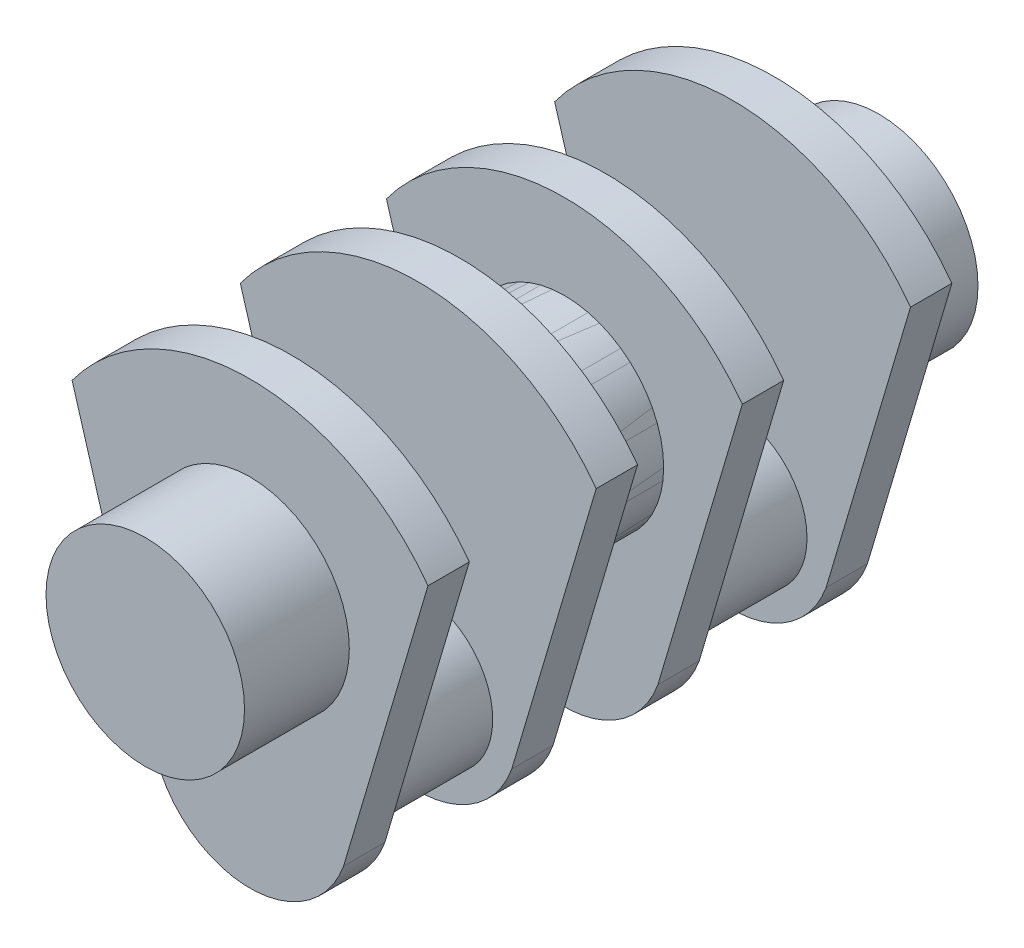
ISO-10303-21;
HEADER;
FILE_DESCRIPTION(('STEP AP214'),'2;1');
FILE_NAME('part.step','',(''),(''),'','','');
FILE_SCHEMA(('AUTOMOTIVE_DESIGN { 1 0 10303 214 1 1 1 1 }'));
ENDSEC;
DATA;
#1=APPLICATION_CONTEXT('core data for automotive mechanical design processes');
#2=APPLICATION_PROTOCOL_DEFINITION('international standard','automotive_design',2000,#1);
#3=PRODUCT_CONTEXT('',#1,'mechanical');
#4=PRODUCT('Part','Part','',(#3));
#5=PRODUCT_RELATED_PRODUCT_CATEGORY('part','',(#4));
#6=PRODUCT_DEFINITION_FORMATION('','',#4);
#7=PRODUCT_DEFINITION_CONTEXT('part definition',#1,'design');
#8=PRODUCT_DEFINITION('design','',#6,#7);
#9=PRODUCT_DEFINITION_SHAPE('','',#8);
#10=(LENGTH_UNIT() NAMED_UNIT(*) SI_UNIT(.MILLI.,.METRE.));
#11=(NAMED_UNIT(*) PLANE_ANGLE_UNIT() SI_UNIT($,.RADIAN.));
#12=(NAMED_UNIT(*) SI_UNIT($,.STERADIAN.) SOLID_ANGLE_UNIT());
#13=UNCERTAINTY_MEASURE_WITH_UNIT(LENGTH_MEASURE(1.E-05),#10,'distance_accuracy_value','');
#14=(GEOMETRIC_REPRESENTATION_CONTEXT(3) GLOBAL_UNCERTAINTY_ASSIGNED_CONTEXT((#13)) GLOBAL_UNIT_ASSIGNED_CONTEXT((#10,
#11,#12)) REPRESENTATION_CONTEXT('',''));
#15=CARTESIAN_POINT('',(0.,0.,0.));
#16=DIRECTION('',(0.,0.,1.));
#17=DIRECTION('',(1.,0.,0.));
#18=AXIS2_PLACEMENT_3D('',#15,#16,#17);
#19=CARTESIAN_POINT('',(2.31456892981108E-13,-335.586011734979,-4445.));
#20=DIRECTION('',(0.,0.,1.));
#21=DIRECTION('',(-1.,0.,0.));
#22=AXIS2_PLACEMENT_3D('',#19,#20,#21);
#23=CYLINDRICAL_SURFACE('',#22,2032.);
#24=CARTESIAN_POINT('',(2.31456892981108E-13,-335.586011734979,-4064.));
#25=DIRECTION('',(0.,0.,1.));
#26=DIRECTION('',(1.,0.,0.));
#27=AXIS2_PLACEMENT_3D('',#24,#25,#26);
#28=CIRCLE('',#27,2032.);
#29=CARTESIAN_POINT('',(-1639.0738814453,865.438888574685,-4064.));
#30=VERTEX_POINT('',#29);
#31=CARTESIAN_POINT('',(1639.0738814453,865.438888574686,-4064.));
#32=VERTEX_POINT('',#31);
#33=EDGE_CURVE('E164',#30,#32,#28,.F.);
#34=ORIENTED_EDGE('',*,*,#33,.T.);
#35=DIRECTION('',(0.,0.,1.));
#36=VECTOR('',#35,1.);
#37=CARTESIAN_POINT('',(1639.0738814453,865.438888574686,-4445.));
#38=LINE('',#37,#36);
#39=CARTESIAN_POINT('',(1639.0738814453,865.438888574686,-4445.));
#40=VERTEX_POINT('',#39);
#41=EDGE_CURVE('E172',#40,#32,#38,.T.);
#42=ORIENTED_EDGE('',*,*,#41,.F.);
#43=CARTESIAN_POINT('',(2.31456892981108E-13,-335.586011734979,-4445.));
#44=DIRECTION('',(0.,0.,1.));
#45=DIRECTION('',(1.,0.,0.));
#46=AXIS2_PLACEMENT_3D('',#43,#44,#45);
#47=CIRCLE('',#46,2032.);
#48=CARTESIAN_POINT('',(-1639.0738814453,865.438888574685,-4445.));
#49=VERTEX_POINT('',#48);
#50=EDGE_CURVE('E165',#49,#40,#47,.F.);
#51=ORIENTED_EDGE('',*,*,#50,.F.);
#52=DIRECTION('',(0.,0.,1.));
#53=VECTOR('',#52,1.);
#54=CARTESIAN_POINT('',(-1639.0738814453,865.438888574685,-4445.));
#55=LINE('',#54,#53);
#56=EDGE_CURVE('E186',#49,#30,#55,.T.);
#57=ORIENTED_EDGE('',*,*,#56,.T.);
#58=EDGE_LOOP('',(#34,#42,#51,#57));
#59=FACE_BOUND('',#58,.T.);
#60=ADVANCED_FACE('F53',(#59),#23,.T.);
#61=CARTESIAN_POINT('',(-1271.18255168187,-376.541426368504,-4445.));
#62=DIRECTION('',(0.958819734868193,0.284015344703924,0.));
#63=DIRECTION('',(-0.284015344703924,0.958819734868193,0.));
#64=AXIS2_PLACEMENT_3D('',#61,#62,#63);
#65=PLANE('',#64);
#66=DIRECTION('',(0.284015344703924,-0.958819734868193,0.));
#67=VECTOR('',#66,1.);
#68=CARTESIAN_POINT('',(-1271.18255168187,-376.541426368504,-4064.));
#69=LINE('',#68,#67);
#70=CARTESIAN_POINT('',(-861.351710039677,-1760.1071605855,-4064.));
#71=VERTEX_POINT('',#70);
#72=EDGE_CURVE('E175',#30,#71,#69,.T.);
#73=ORIENTED_EDGE('',*,*,#72,.F.);
#74=ORIENTED_EDGE('',*,*,#56,.F.);
#75=DIRECTION('',(0.284015344703924,-0.958819734868193,0.));
#76=VECTOR('',#75,1.);
#77=CARTESIAN_POINT('',(-1271.18255168187,-376.541426368504,-4445.));
#78=LINE('',#77,#76);
#79=CARTESIAN_POINT('',(-861.351710039677,-1760.1071605855,-4445.));
#80=VERTEX_POINT('',#79);
#81=EDGE_CURVE('E96',#49,#80,#78,.T.);
#82=ORIENTED_EDGE('',*,*,#81,.T.);
#83=DIRECTION('',(0.,0.,1.));
#84=VECTOR('',#83,1.);
#85=CARTESIAN_POINT('',(-861.351710039677,-1760.1071605855,-4445.));
#86=LINE('',#85,#84);
#87=EDGE_CURVE('E184',#80,#71,#86,.T.);
#88=ORIENTED_EDGE('',*,*,#87,.T.);
#89=EDGE_LOOP('',(#73,#74,#82,#88));
#90=FACE_BOUND('',#89,.T.);
#91=ADVANCED_FACE('F211',(#90),#65,.F.);
#92=CARTESIAN_POINT('',(0.,-1453.18601173498,-4445.));
#93=DIRECTION('',(0.,0.,1.));
#94=DIRECTION('',(-1.,0.,0.));
#95=AXIS2_PLACEMENT_3D('',#92,#93,#94);
#96=CYLINDRICAL_SURFACE('',#95,914.4);
#97=CARTESIAN_POINT('',(0.,-1453.18601173498,-4064.));
#98=DIRECTION('',(0.,0.,1.));
#99=DIRECTION('',(1.,0.,0.));
#100=AXIS2_PLACEMENT_3D('',#97,#98,#99);
#101=CIRCLE('',#100,914.4);
#102=CARTESIAN_POINT('',(861.351710039677,-1760.1071605855,-4064.));
#103=VERTEX_POINT('',#102);
#104=EDGE_CURVE('E178',#71,#103,#101,.T.);
#105=ORIENTED_EDGE('',*,*,#104,.F.);
#106=ORIENTED_EDGE('',*,*,#87,.F.);
#107=CARTESIAN_POINT('',(0.,-1453.18601173498,-4445.));
#108=DIRECTION('',(0.,0.,1.));
#109=DIRECTION('',(1.,0.,0.));
#110=AXIS2_PLACEMENT_3D('',#107,#108,#109);
#111=CIRCLE('',#110,914.4);
#112=CARTESIAN_POINT('',(861.351710039677,-1760.1071605855,-4445.));
#113=VERTEX_POINT('',#112);
#114=EDGE_CURVE('E168',#80,#113,#111,.T.);
#115=ORIENTED_EDGE('',*,*,#114,.T.);
#116=DIRECTION('',(0.,0.,1.));
#117=VECTOR('',#116,1.);
#118=CARTESIAN_POINT('',(861.351710039677,-1760.1071605855,-4445.));
#119=LINE('',#118,#117);
#120=EDGE_CURVE('E182',#113,#103,#119,.T.);
#121=ORIENTED_EDGE('',*,*,#120,.T.);
#122=EDGE_LOOP('',(#105,#106,#115,#121));
#123=FACE_BOUND('',#122,.T.);
#124=ADVANCED_FACE('F215',(#123),#96,.T.);
#125=CARTESIAN_POINT('',(1271.18255168187,-376.541426368504,-4445.));
#126=DIRECTION('',(0.958819734868193,-0.284015344703924,0.));
#127=DIRECTION('',(0.284015344703924,0.958819734868193,0.));
#128=AXIS2_PLACEMENT_3D('',#125,#126,#127);
#129=PLANE('',#128);
#130=DIRECTION('',(-0.284015344703924,-0.958819734868193,0.));
#131=VECTOR('',#130,1.);
#132=CARTESIAN_POINT('',(1271.18255168187,-376.541426368504,-4064.));
#133=LINE('',#132,#131);
#134=EDGE_CURVE('E85',#32,#103,#133,.T.);
#135=ORIENTED_EDGE('',*,*,#134,.T.);
#136=ORIENTED_EDGE('',*,*,#120,.F.);
#137=DIRECTION('',(-0.284015344703924,-0.958819734868193,0.));
#138=VECTOR('',#137,1.);
#139=CARTESIAN_POINT('',(1271.18255168187,-376.541426368504,-4445.));
#140=LINE('',#139,#138);
#141=EDGE_CURVE('E70',#40,#113,#140,.T.);
#142=ORIENTED_EDGE('',*,*,#141,.F.);
#143=ORIENTED_EDGE('',*,*,#41,.T.);
#144=EDGE_LOOP('',(#135,#136,#142,#143));
#145=FACE_BOUND('',#144,.T.);
#146=ADVANCED_FACE('F220',(#145),#129,.T.);
#147=CARTESIAN_POINT('',(0.,0.,-4445.));
#148=DIRECTION('',(0.,0.,-1.));
#149=DIRECTION('',(1.,0.,0.));
#150=AXIS2_PLACEMENT_3D('',#147,#148,#149);
#151=PLANE('',#150);
#152=CARTESIAN_POINT('',(0.,0.,-4445.));
#153=DIRECTION('',(0.,0.,1.));
#154=DIRECTION('',(1.,0.,0.));
#155=AXIS2_PLACEMENT_3D('',#152,#153,#154);
#156=CIRCLE('',#155,914.4);
#157=CARTESIAN_POINT('',(914.4,0.,-4445.));
#158=VERTEX_POINT('',#157);
#159=EDGE_CURVE('E12',#158,#158,#156,.T.);
#160=ORIENTED_EDGE('',*,*,#159,.T.);
#161=EDGE_LOOP('',(#160));
#162=FACE_BOUND('',#161,.T.);
#163=ORIENTED_EDGE('',*,*,#50,.T.);
#164=ORIENTED_EDGE('',*,*,#141,.T.);
#165=ORIENTED_EDGE('',*,*,#114,.F.);
#166=ORIENTED_EDGE('',*,*,#81,.F.);
#167=EDGE_LOOP('',(#163,#164,#165,#166));
#168=FACE_BOUND('',#167,.T.);
#169=ADVANCED_FACE('F207',(#162,#168),#151,.T.);
#170=CARTESIAN_POINT('',(0.,0.,-4064.));
#171=DIRECTION('',(0.,0.,-1.));
#172=DIRECTION('',(1.,0.,0.));
#173=AXIS2_PLACEMENT_3D('',#170,#171,#172);
#174=PLANE('',#173);
#175=CARTESIAN_POINT('',(0.,-1453.18601173498,-4064.));
#176=DIRECTION('',(0.,0.,1.));
#177=DIRECTION('',(1.,0.,0.));
#178=AXIS2_PLACEMENT_3D('',#175,#176,#177);
#179=CIRCLE('',#178,685.8);
#180=CARTESIAN_POINT('',(685.8,-1453.18601173498,-4064.));
#181=VERTEX_POINT('',#180);
#182=EDGE_CURVE('E56',#181,#181,#179,.F.);
#183=ORIENTED_EDGE('',*,*,#182,.T.);
#184=EDGE_LOOP('',(#183));
#185=FACE_BOUND('',#184,.T.);
#186=ORIENTED_EDGE('',*,*,#33,.F.);
#187=ORIENTED_EDGE('',*,*,#72,.T.);
#188=ORIENTED_EDGE('',*,*,#104,.T.);
#189=ORIENTED_EDGE('',*,*,#134,.F.);
#190=EDGE_LOOP('',(#186,#187,#188,#189));
#191=FACE_BOUND('',#190,.T.);
#192=ADVANCED_FACE('F193',(#185,#191),#174,.F.);
#193=CARTESIAN_POINT('',(0.,-1453.18601173498,-2895.6));
#194=DIRECTION('',(0.,0.,-1.));
#195=DIRECTION('',(1.,0.,0.));
#196=AXIS2_PLACEMENT_3D('',#193,#194,#195);
#197=CYLINDRICAL_SURFACE('',#196,685.8);
#198=CARTESIAN_POINT('',(0.,-1453.18601173498,-2895.6));
#199=DIRECTION('',(0.,0.,-1.));
#200=DIRECTION('',(-1.,0.,0.));
#201=AXIS2_PLACEMENT_3D('',#198,#199,#200);
#202=CIRCLE('',#201,685.8);
#203=CARTESIAN_POINT('',(-685.8,-1453.18601173498,-2895.6));
#204=VERTEX_POINT('',#203);
#205=EDGE_CURVE('E160',#204,#204,#202,.T.);
#206=ORIENTED_EDGE('',*,*,#205,.T.);
#207=EDGE_LOOP('',(#206));
#208=FACE_BOUND('',#207,.T.);
#209=ORIENTED_EDGE('',*,*,#182,.F.);
#210=EDGE_LOOP('',(#209));
#211=FACE_BOUND('',#210,.T.);
#212=ADVANCED_FACE('F195',(#208,#211),#197,.T.);
#213=CARTESIAN_POINT('',(0.,0.,-5410.2));
#214=DIRECTION('',(0.,0.,1.));
#215=DIRECTION('',(-1.,0.,0.));
#216=AXIS2_PLACEMENT_3D('',#213,#214,#215);
#217=CYLINDRICAL_SURFACE('',#216,914.4);
#218=CARTESIAN_POINT('',(0.,0.,-5410.2));
#219=DIRECTION('',(0.,0.,1.));
#220=DIRECTION('',(1.,0.,0.));
#221=AXIS2_PLACEMENT_3D('',#218,#219,#220);
#222=CIRCLE('',#221,914.4);
#223=CARTESIAN_POINT('',(914.4,0.,-5410.2));
#224=VERTEX_POINT('',#223);
#225=EDGE_CURVE('E153',#224,#224,#222,.T.);
#226=ORIENTED_EDGE('',*,*,#225,.T.);
#227=EDGE_LOOP('',(#226));
#228=FACE_BOUND('',#227,.T.);
#229=ORIENTED_EDGE('',*,*,#159,.F.);
#230=EDGE_LOOP('',(#229));
#231=FACE_BOUND('',#230,.T.);
#232=ADVANCED_FACE('F197',(#228,#231),#217,.T.);
#233=CARTESIAN_POINT('',(0.,0.,-5410.2));
#234=DIRECTION('',(0.,0.,-1.));
#235=DIRECTION('',(1.,0.,0.));
#236=AXIS2_PLACEMENT_3D('',#233,#234,#235);
#237=PLANE('',#236);
#238=ORIENTED_EDGE('',*,*,#225,.F.);
#239=EDGE_LOOP('',(#238));
#240=FACE_BOUND('',#239,.T.);
#241=ADVANCED_FACE('F204',(#240),#237,.T.);
#242=CARTESIAN_POINT('',(2.31456892981108E-13,-335.586011734979,-2514.6));
#243=DIRECTION('',(0.,0.,-1.));
#244=DIRECTION('',(-1.,0.,0.));
#245=AXIS2_PLACEMENT_3D('',#242,#243,#244);
#246=CYLINDRICAL_SURFACE('',#245,2032.);
#247=CARTESIAN_POINT('',(2.31456892981108E-13,-335.586011734979,-2895.6));
#248=DIRECTION('',(0.,0.,1.));
#249=DIRECTION('',(1.,0.,0.));
#250=AXIS2_PLACEMENT_3D('',#247,#248,#249);
#251=CIRCLE('',#250,2032.);
#252=CARTESIAN_POINT('',(-1639.0738814453,865.438888574685,-2895.6));
#253=VERTEX_POINT('',#252);
#254=CARTESIAN_POINT('',(1639.0738814453,865.438888574686,-2895.6));
#255=VERTEX_POINT('',#254);
#256=EDGE_CURVE('E149',#253,#255,#251,.F.);
#257=ORIENTED_EDGE('',*,*,#256,.F.);
#258=DIRECTION('',(0.,0.,-1.));
#259=VECTOR('',#258,1.);
#260=CARTESIAN_POINT('',(-1639.0738814453,865.438888574685,-2514.6));
#261=LINE('',#260,#259);
#262=CARTESIAN_POINT('',(-1639.0738814453,865.438888574685,-2514.6));
#263=VERTEX_POINT('',#262);
#264=EDGE_CURVE('E130',#263,#253,#261,.T.);
#265=ORIENTED_EDGE('',*,*,#264,.F.);
#266=CARTESIAN_POINT('',(2.31456892981108E-13,-335.586011734979,-2514.6));
#267=DIRECTION('',(0.,0.,1.));
#268=DIRECTION('',(1.,0.,0.));
#269=AXIS2_PLACEMENT_3D('',#266,#267,#268);
#270=CIRCLE('',#269,2032.);
#271=CARTESIAN_POINT('',(1639.0738814453,865.438888574686,-2514.6));
#272=VERTEX_POINT('',#271);
#273=EDGE_CURVE('E137',#263,#272,#270,.F.);
#274=ORIENTED_EDGE('',*,*,#273,.T.);
#275=DIRECTION('',(0.,0.,-1.));
#276=VECTOR('',#275,1.);
#277=CARTESIAN_POINT('',(1639.0738814453,865.438888574686,-2514.6));
#278=LINE('',#277,#276);
#279=EDGE_CURVE('E374',#272,#255,#278,.T.);
#280=ORIENTED_EDGE('',*,*,#279,.T.);
#281=EDGE_LOOP('',(#257,#265,#274,#280));
#282=FACE_BOUND('',#281,.T.);
#283=ADVANCED_FACE('F147',(#282),#246,.T.);
#284=CARTESIAN_POINT('',(-1271.18255168187,-376.541426368504,-2514.6));
#285=DIRECTION('',(0.958819734868193,0.284015344703924,0.));
#286=DIRECTION('',(-0.284015344703924,0.958819734868193,0.));
#287=AXIS2_PLACEMENT_3D('',#284,#285,#286);
#288=PLANE('',#287);
#289=DIRECTION('',(0.284015344703924,-0.958819734868193,0.));
#290=VECTOR('',#289,1.);
#291=CARTESIAN_POINT('',(-1271.18255168187,-376.541426368504,-2895.6));
#292=LINE('',#291,#290);
#293=CARTESIAN_POINT('',(-861.351710039677,-1760.1071605855,-2895.6));
#294=VERTEX_POINT('',#293);
#295=EDGE_CURVE('E370',#253,#294,#292,.T.);
#296=ORIENTED_EDGE('',*,*,#295,.T.);
#297=DIRECTION('',(0.,0.,-1.));
#298=VECTOR('',#297,1.);
#299=CARTESIAN_POINT('',(-861.351710039677,-1760.1071605855,-2514.6));
#300=LINE('',#299,#298);
#301=CARTESIAN_POINT('',(-861.351710039677,-1760.1071605855,-2514.6));
#302=VERTEX_POINT('',#301);
#303=EDGE_CURVE('E133',#302,#294,#300,.T.);
#304=ORIENTED_EDGE('',*,*,#303,.F.);
#305=DIRECTION('',(0.284015344703924,-0.958819734868193,0.));
#306=VECTOR('',#305,1.);
#307=CARTESIAN_POINT('',(-1271.18255168187,-376.541426368504,-2514.6));
#308=LINE('',#307,#306);
#309=EDGE_CURVE('E125',#263,#302,#308,.T.);
#310=ORIENTED_EDGE('',*,*,#309,.F.);
#311=ORIENTED_EDGE('',*,*,#264,.T.);
#312=EDGE_LOOP('',(#296,#304,#310,#311));
#313=FACE_BOUND('',#312,.T.);
#314=ADVANCED_FACE('F128',(#313),#288,.F.);
#315=CARTESIAN_POINT('',(0.,-1453.18601173498,-2514.6));
#316=DIRECTION('',(0.,0.,-1.));
#317=DIRECTION('',(-1.,0.,0.));
#318=AXIS2_PLACEMENT_3D('',#315,#316,#317);
#319=CYLINDRICAL_SURFACE('',#318,914.4);
#320=CARTESIAN_POINT('',(0.,-1453.18601173498,-2895.6));
#321=DIRECTION('',(0.,0.,1.));
#322=DIRECTION('',(1.,0.,0.));
#323=AXIS2_PLACEMENT_3D('',#320,#321,#322);
#324=CIRCLE('',#323,914.4);
#325=CARTESIAN_POINT('',(861.351710039677,-1760.1071605855,-2895.6));
#326=VERTEX_POINT('',#325);
#327=EDGE_CURVE('E377',#294,#326,#324,.T.);
#328=ORIENTED_EDGE('',*,*,#327,.T.);
#329=DIRECTION('',(0.,0.,-1.));
#330=VECTOR('',#329,1.);
#331=CARTESIAN_POINT('',(861.351710039677,-1760.1071605855,-2514.6));
#332=LINE('',#331,#330);
#333=CARTESIAN_POINT('',(861.351710039677,-1760.1071605855,-2514.6));
#334=VERTEX_POINT('',#333);
#335=EDGE_CURVE('E155',#334,#326,#332,.T.);
#336=ORIENTED_EDGE('',*,*,#335,.F.);
#337=CARTESIAN_POINT('',(0.,-1453.18601173498,-2514.6));
#338=DIRECTION('',(0.,0.,1.));
#339=DIRECTION('',(1.,0.,0.));
#340=AXIS2_PLACEMENT_3D('',#337,#338,#339);
#341=CIRCLE('',#340,914.4);
#342=EDGE_CURVE('E136',#302,#334,#341,.T.);
#343=ORIENTED_EDGE('',*,*,#342,.F.);
#344=ORIENTED_EDGE('',*,*,#303,.T.);
#345=EDGE_LOOP('',(#328,#336,#343,#344));
#346=FACE_BOUND('',#345,.T.);
#347=ADVANCED_FACE('F296',(#346),#319,.T.);
#348=CARTESIAN_POINT('',(1271.18255168187,-376.541426368504,-2514.6));
#349=DIRECTION('',(0.958819734868193,-0.284015344703924,0.));
#350=DIRECTION('',(0.284015344703924,0.958819734868193,0.));
#351=AXIS2_PLACEMENT_3D('',#348,#349,#350);
#352=PLANE('',#351);
#353=DIRECTION('',(-0.284015344703924,-0.958819734868193,0.));
#354=VECTOR('',#353,1.);
#355=CARTESIAN_POINT('',(1271.18255168187,-376.541426368504,-2895.6));
#356=LINE('',#355,#354);
#357=EDGE_CURVE('E145',#255,#326,#356,.T.);
#358=ORIENTED_EDGE('',*,*,#357,.F.);
#359=ORIENTED_EDGE('',*,*,#279,.F.);
#360=DIRECTION('',(-0.284015344703924,-0.958819734868193,0.));
#361=VECTOR('',#360,1.);
#362=CARTESIAN_POINT('',(1271.18255168187,-376.541426368504,-2514.6));
#363=LINE('',#362,#361);
#364=EDGE_CURVE('E141',#272,#334,#363,.T.);
#365=ORIENTED_EDGE('',*,*,#364,.T.);
#366=ORIENTED_EDGE('',*,*,#335,.T.);
#367=EDGE_LOOP('',(#358,#359,#365,#366));
#368=FACE_BOUND('',#367,.T.);
#369=ADVANCED_FACE('F304',(#368),#352,.T.);
#370=CARTESIAN_POINT('',(0.,0.,-2514.6));
#371=DIRECTION('',(0.,0.,1.));
#372=DIRECTION('',(1.,0.,0.));
#373=AXIS2_PLACEMENT_3D('',#370,#371,#372);
#374=PLANE('',#373);
#375=CARTESIAN_POINT('',(0.,0.,-2514.6));
#376=DIRECTION('',(0.,0.,1.));
#377=DIRECTION('',(1.,0.,0.));
#378=AXIS2_PLACEMENT_3D('',#375,#376,#377);
#379=CIRCLE('',#378,914.4);
#380=CARTESIAN_POINT('',(914.4,0.,-2514.6));
#381=VERTEX_POINT('',#380);
#382=EDGE_CURVE('E150',#381,#381,#379,.T.);
#383=ORIENTED_EDGE('',*,*,#382,.F.);
#384=EDGE_LOOP('',(#383));
#385=FACE_BOUND('',#384,.T.);
#386=ORIENTED_EDGE('',*,*,#273,.F.);
#387=ORIENTED_EDGE('',*,*,#309,.T.);
#388=ORIENTED_EDGE('',*,*,#342,.T.);
#389=ORIENTED_EDGE('',*,*,#364,.F.);
#390=EDGE_LOOP('',(#386,#387,#388,#389));
#391=FACE_BOUND('',#390,.T.);
#392=ADVANCED_FACE('F140',(#385,#391),#374,.T.);
#393=CARTESIAN_POINT('',(0.,0.,-2895.6));
#394=DIRECTION('',(0.,0.,1.));
#395=DIRECTION('',(1.,0.,0.));
#396=AXIS2_PLACEMENT_3D('',#393,#394,#395);
#397=PLANE('',#396);
#398=ORIENTED_EDGE('',*,*,#205,.F.);
#399=EDGE_LOOP('',(#398));
#400=FACE_BOUND('',#399,.T.);
#401=ORIENTED_EDGE('',*,*,#256,.T.);
#402=ORIENTED_EDGE('',*,*,#357,.T.);
#403=ORIENTED_EDGE('',*,*,#327,.F.);
#404=ORIENTED_EDGE('',*,*,#295,.F.);
#405=EDGE_LOOP('',(#401,#402,#403,#404));
#406=FACE_BOUND('',#405,.T.);
#407=ADVANCED_FACE('F321',(#400,#406),#397,.F.);
#408=CARTESIAN_POINT('',(0.,0.,-1549.4));
#409=DIRECTION('',(0.,0.,-1.));
#410=DIRECTION('',(-1.,0.,0.));
#411=AXIS2_PLACEMENT_3D('',#408,#409,#410);
#412=CYLINDRICAL_SURFACE('',#411,914.4);
#413=CARTESIAN_POINT('',(0.,0.,-1549.4));
#414=DIRECTION('',(0.,0.,1.));
#415=DIRECTION('',(1.,0.,0.));
#416=AXIS2_PLACEMENT_3D('',#413,#414,#415);
#417=CIRCLE('',#416,914.4);
#418=CARTESIAN_POINT('',(914.4,0.,-1549.4));
#419=VERTEX_POINT('',#418);
#420=EDGE_CURVE('E368',#419,#419,#417,.T.);
#421=ORIENTED_EDGE('',*,*,#420,.F.);
#422=EDGE_LOOP('',(#421));
#423=FACE_BOUND('',#422,.T.);
#424=ORIENTED_EDGE('',*,*,#382,.T.);
#425=EDGE_LOOP('',(#424));
#426=FACE_BOUND('',#425,.T.);
#427=ADVANCED_FACE('F333',(#423,#426),#412,.T.);
#428=CARTESIAN_POINT('',(0.,0.,-1549.4));
#429=DIRECTION('',(0.,0.,1.));
#430=DIRECTION('',(1.,0.,0.));
#431=AXIS2_PLACEMENT_3D('',#428,#429,#430);
#432=PLANE('',#431);
#433=ORIENTED_EDGE('',*,*,#420,.T.);
#434=EDGE_LOOP('',(#433));
#435=FACE_BOUND('',#434,.T.);
#436=ADVANCED_FACE('F345',(#435),#432,.T.);
#437=CLOSED_SHELL('',(#60,#91,#124,#146,#169,#192,#212,#232,#241,#283,#314,#347,#369,#392,#407,
#427,#436));
#438=MANIFOLD_SOLID_BREP('B2',#437);
#439=CARTESIAN_POINT('',(2.31456892981108E-13,-335.586011734979,381.));
#440=DIRECTION('',(0.,0.,-1.));
#441=DIRECTION('',(-1.,0.,0.));
#442=AXIS2_PLACEMENT_3D('',#439,#440,#441);
#443=CYLINDRICAL_SURFACE('',#442,2032.);
#444=CARTESIAN_POINT('',(2.31456892981108E-13,-335.586011734979,0.));
#445=DIRECTION('',(0.,0.,1.));
#446=DIRECTION('',(1.,0.,0.));
#447=AXIS2_PLACEMENT_3D('',#444,#445,#446);
#448=CIRCLE('',#447,2032.);
#449=CARTESIAN_POINT('',(-1639.0738814453,865.438888574685,0.));
#450=VERTEX_POINT('',#449);
#451=CARTESIAN_POINT('',(1639.0738814453,865.438888574686,0.));
#452=VERTEX_POINT('',#451);
#453=EDGE_CURVE('E519',#450,#452,#448,.F.);
#454=ORIENTED_EDGE('',*,*,#453,.F.);
#455=DIRECTION('',(0.,0.,-1.));
#456=VECTOR('',#455,1.);
#457=CARTESIAN_POINT('',(-1639.0738814453,865.438888574685,381.));
#458=LINE('',#457,#456);
#459=CARTESIAN_POINT('',(-1639.0738814453,865.438888574685,381.));
#460=VERTEX_POINT('',#459);
#461=EDGE_CURVE('E437',#460,#450,#458,.T.);
#462=ORIENTED_EDGE('',*,*,#461,.F.);
#463=CARTESIAN_POINT('',(2.31456892981108E-13,-335.586011734979,381.));
#464=DIRECTION('',(0.,0.,1.));
#465=DIRECTION('',(1.,0.,0.));
#466=AXIS2_PLACEMENT_3D('',#463,#464,#465);
#467=CIRCLE('',#466,2032.);
#468=CARTESIAN_POINT('',(1639.0738814453,865.438888574686,381.));
#469=VERTEX_POINT('',#468);
#470=EDGE_CURVE('E520',#460,#469,#467,.F.);
#471=ORIENTED_EDGE('',*,*,#470,.T.);
#472=DIRECTION('',(0.,0.,-1.));
#473=VECTOR('',#472,1.);
#474=CARTESIAN_POINT('',(1639.0738814453,865.438888574686,381.));
#475=LINE('',#474,#473);
#476=EDGE_CURVE('E413',#469,#452,#475,.T.);
#477=ORIENTED_EDGE('',*,*,#476,.T.);
#478=EDGE_LOOP('',(#454,#462,#471,#477));
#479=FACE_BOUND('',#478,.T.);
#480=ADVANCED_FACE('F396',(#479),#443,.T.);
#481=CARTESIAN_POINT('',(-1271.18255168187,-376.541426368504,381.));
#482=DIRECTION('',(0.958819734868193,0.284015344703924,0.));
#483=DIRECTION('',(-0.284015344703924,0.958819734868193,0.));
#484=AXIS2_PLACEMENT_3D('',#481,#482,#483);
#485=PLANE('',#484);
#486=DIRECTION('',(0.284015344703924,-0.958819734868193,0.));
#487=VECTOR('',#486,1.);
#488=CARTESIAN_POINT('',(-1271.18255168187,-376.541426368504,0.));
#489=LINE('',#488,#487);
#490=CARTESIAN_POINT('',(-861.351710039677,-1760.1071605855,0.));
#491=VERTEX_POINT('',#490);
#492=EDGE_CURVE('E530',#450,#491,#489,.T.);
#493=ORIENTED_EDGE('',*,*,#492,.T.);
#494=DIRECTION('',(0.,0.,-1.));
#495=VECTOR('',#494,1.);
#496=CARTESIAN_POINT('',(-861.351710039677,-1760.1071605855,381.));
#497=LINE('',#496,#495);
#498=CARTESIAN_POINT('',(-861.351710039677,-1760.1071605855,381.));
#499=VERTEX_POINT('',#498);
#500=EDGE_CURVE('E538',#499,#491,#497,.T.);
#501=ORIENTED_EDGE('',*,*,#500,.F.);
#502=DIRECTION('',(0.284015344703924,-0.958819734868193,0.));
#503=VECTOR('',#502,1.);
#504=CARTESIAN_POINT('',(-1271.18255168187,-376.541426368504,381.));
#505=LINE('',#504,#503);
#506=EDGE_CURVE('E522',#460,#499,#505,.T.);
#507=ORIENTED_EDGE('',*,*,#506,.F.);
#508=ORIENTED_EDGE('',*,*,#461,.T.);
#509=EDGE_LOOP('',(#493,#501,#507,#508));
#510=FACE_BOUND('',#509,.T.);
#511=ADVANCED_FACE('F563',(#510),#485,.F.);
#512=CARTESIAN_POINT('',(0.,-1453.18601173498,381.));
#513=DIRECTION('',(0.,0.,-1.));
#514=DIRECTION('',(-1.,0.,0.));
#515=AXIS2_PLACEMENT_3D('',#512,#513,#514);
#516=CYLINDRICAL_SURFACE('',#515,914.4);
#517=CARTESIAN_POINT('',(0.,-1453.18601173498,0.));
#518=DIRECTION('',(0.,0.,1.));
#519=DIRECTION('',(1.,0.,0.));
#520=AXIS2_PLACEMENT_3D('',#517,#518,#519);
#521=CIRCLE('',#520,914.4);
#522=CARTESIAN_POINT('',(861.351710039677,-1760.1071605855,0.));
#523=VERTEX_POINT('',#522);
#524=EDGE_CURVE('E532',#491,#523,#521,.T.);
#525=ORIENTED_EDGE('',*,*,#524,.T.);
#526=DIRECTION('',(0.,0.,-1.));
#527=VECTOR('',#526,1.);
#528=CARTESIAN_POINT('',(861.351710039677,-1760.1071605855,381.));
#529=LINE('',#528,#527);
#530=CARTESIAN_POINT('',(861.351710039677,-1760.1071605855,381.));
#531=VERTEX_POINT('',#530);
#532=EDGE_CURVE('E429',#531,#523,#529,.T.);
#533=ORIENTED_EDGE('',*,*,#532,.F.);
#534=CARTESIAN_POINT('',(0.,-1453.18601173498,381.));
#535=DIRECTION('',(0.,0.,1.));
#536=DIRECTION('',(1.,0.,0.));
#537=AXIS2_PLACEMENT_3D('',#534,#535,#536);
#538=CIRCLE('',#537,914.4);
#539=EDGE_CURVE('E525',#499,#531,#538,.T.);
#540=ORIENTED_EDGE('',*,*,#539,.F.);
#541=ORIENTED_EDGE('',*,*,#500,.T.);
#542=EDGE_LOOP('',(#525,#533,#540,#541));
#543=FACE_BOUND('',#542,.T.);
#544=ADVANCED_FACE('F555',(#543),#516,.T.);
#545=CARTESIAN_POINT('',(1271.18255168187,-376.541426368504,381.));
#546=DIRECTION('',(0.958819734868193,-0.284015344703924,0.));
#547=DIRECTION('',(0.284015344703924,0.958819734868193,0.));
#548=AXIS2_PLACEMENT_3D('',#545,#546,#547);
#549=PLANE('',#548);
#550=DIRECTION('',(-0.284015344703924,-0.958819734868193,0.));
#551=VECTOR('',#550,1.);
#552=CARTESIAN_POINT('',(1271.18255168187,-376.541426368504,0.));
#553=LINE('',#552,#551);
#554=EDGE_CURVE('E523',#452,#523,#553,.T.);
#555=ORIENTED_EDGE('',*,*,#554,.F.);
#556=ORIENTED_EDGE('',*,*,#476,.F.);
#557=DIRECTION('',(-0.284015344703924,-0.958819734868193,0.));
#558=VECTOR('',#557,1.);
#559=CARTESIAN_POINT('',(1271.18255168187,-376.541426368504,381.));
#560=LINE('',#559,#558);
#561=EDGE_CURVE('E527',#469,#531,#560,.T.);
#562=ORIENTED_EDGE('',*,*,#561,.T.);
#563=ORIENTED_EDGE('',*,*,#532,.T.);
#564=EDGE_LOOP('',(#555,#556,#562,#563));
#565=FACE_BOUND('',#564,.T.);
#566=ADVANCED_FACE('F553',(#565),#549,.T.);
#567=CARTESIAN_POINT('',(0.,0.,381.));
#568=DIRECTION('',(0.,0.,1.));
#569=DIRECTION('',(1.,0.,0.));
#570=AXIS2_PLACEMENT_3D('',#567,#568,#569);
#571=PLANE('',#570);
#572=CARTESIAN_POINT('',(0.,0.,381.));
#573=DIRECTION('',(0.,0.,1.));
#574=DIRECTION('',(1.,0.,0.));
#575=AXIS2_PLACEMENT_3D('',#572,#573,#574);
#576=CIRCLE('',#575,914.4);
#577=CARTESIAN_POINT('',(914.4,0.,381.));
#578=VERTEX_POINT('',#577);
#579=EDGE_CURVE('E51',#578,#578,#576,.T.);
#580=ORIENTED_EDGE('',*,*,#579,.F.);
#581=EDGE_LOOP('',(#580));
#582=FACE_BOUND('',#581,.T.);
#583=ORIENTED_EDGE('',*,*,#470,.F.);
#584=ORIENTED_EDGE('',*,*,#506,.T.);
#585=ORIENTED_EDGE('',*,*,#539,.T.);
#586=ORIENTED_EDGE('',*,*,#561,.F.);
#587=EDGE_LOOP('',(#583,#584,#585,#586));
#588=FACE_BOUND('',#587,.T.);
#589=ADVANCED_FACE('F550',(#582,#588),#571,.T.);
#590=CARTESIAN_POINT('',(0.,0.,0.));
#591=DIRECTION('',(0.,0.,1.));
#592=DIRECTION('',(1.,0.,0.));
#593=AXIS2_PLACEMENT_3D('',#590,#591,#592);
#594=PLANE('',#593);
#595=CARTESIAN_POINT('',(0.,-1453.18601173498,0.));
#596=DIRECTION('',(0.,0.,1.));
#597=DIRECTION('',(1.,0.,0.));
#598=AXIS2_PLACEMENT_3D('',#595,#596,#597);
#599=CIRCLE('',#598,685.8);
#600=CARTESIAN_POINT('',(685.8,-1453.18601173498,0.));
#601=VERTEX_POINT('',#600);
#602=EDGE_CURVE('E399',#601,#601,#599,.F.);
#603=ORIENTED_EDGE('',*,*,#602,.F.);
#604=EDGE_LOOP('',(#603));
#605=FACE_BOUND('',#604,.T.);
#606=ORIENTED_EDGE('',*,*,#453,.T.);
#607=ORIENTED_EDGE('',*,*,#554,.T.);
#608=ORIENTED_EDGE('',*,*,#524,.F.);
#609=ORIENTED_EDGE('',*,*,#492,.F.);
#610=EDGE_LOOP('',(#606,#607,#608,#609));
#611=FACE_BOUND('',#610,.T.);
#612=ADVANCED_FACE('F547',(#605,#611),#594,.F.);
#613=CARTESIAN_POINT('',(0.,-1453.18601173498,-1168.4));
#614=DIRECTION('',(0.,0.,1.));
#615=DIRECTION('',(1.,0.,0.));
#616=AXIS2_PLACEMENT_3D('',#613,#614,#615);
#617=CYLINDRICAL_SURFACE('',#616,685.8);
#618=CARTESIAN_POINT('',(0.,-1453.18601173498,-1168.4));
#619=DIRECTION('',(0.,0.,-1.));
#620=DIRECTION('',(-1.,0.,0.));
#621=AXIS2_PLACEMENT_3D('',#618,#619,#620);
#622=CIRCLE('',#621,685.8);
#623=CARTESIAN_POINT('',(-685.8,-1453.18601173498,-1168.4));
#624=VERTEX_POINT('',#623);
#625=EDGE_CURVE('E515',#624,#624,#622,.T.);
#626=ORIENTED_EDGE('',*,*,#625,.F.);
#627=EDGE_LOOP('',(#626));
#628=FACE_BOUND('',#627,.T.);
#629=ORIENTED_EDGE('',*,*,#602,.T.);
#630=EDGE_LOOP('',(#629));
#631=FACE_BOUND('',#630,.T.);
#632=ADVANCED_FACE('F545',(#628,#631),#617,.T.);
#633=CARTESIAN_POINT('',(0.,0.,1346.2));
#634=DIRECTION('',(0.,0.,-1.));
#635=DIRECTION('',(-1.,0.,0.));
#636=AXIS2_PLACEMENT_3D('',#633,#634,#635);
#637=CYLINDRICAL_SURFACE('',#636,914.4);
#638=CARTESIAN_POINT('',(0.,0.,1346.2));
#639=DIRECTION('',(0.,0.,1.));
#640=DIRECTION('',(1.,0.,0.));
#641=AXIS2_PLACEMENT_3D('',#638,#639,#640);
#642=CIRCLE('',#641,914.4);
#643=CARTESIAN_POINT('',(914.4,0.,1346.2));
#644=VERTEX_POINT('',#643);
#645=EDGE_CURVE('E513',#644,#644,#642,.T.);
#646=ORIENTED_EDGE('',*,*,#645,.F.);
#647=EDGE_LOOP('',(#646));
#648=FACE_BOUND('',#647,.T.);
#649=ORIENTED_EDGE('',*,*,#579,.T.);
#650=EDGE_LOOP('',(#649));
#651=FACE_BOUND('',#650,.T.);
#652=ADVANCED_FACE('F601',(#648,#651),#637,.T.);
#653=CARTESIAN_POINT('',(0.,0.,1346.2));
#654=DIRECTION('',(0.,0.,1.));
#655=DIRECTION('',(1.,0.,0.));
#656=AXIS2_PLACEMENT_3D('',#653,#654,#655);
#657=PLANE('',#656);
#658=ORIENTED_EDGE('',*,*,#645,.T.);
#659=EDGE_LOOP('',(#658));
#660=FACE_BOUND('',#659,.T.);
#661=ADVANCED_FACE('F611',(#660),#657,.T.);
#662=CARTESIAN_POINT('',(2.31456892981108E-13,-335.586011734979,-1549.4));
#663=DIRECTION('',(0.,0.,1.));
#664=DIRECTION('',(-1.,0.,0.));
#665=AXIS2_PLACEMENT_3D('',#662,#663,#664);
#666=CYLINDRICAL_SURFACE('',#665,2032.);
#667=CARTESIAN_POINT('',(2.31456892981108E-13,-335.586011734979,-1168.4));
#668=DIRECTION('',(0.,0.,1.));
#669=DIRECTION('',(1.,0.,0.));
#670=AXIS2_PLACEMENT_3D('',#667,#668,#669);
#671=CIRCLE('',#670,2032.);
#672=CARTESIAN_POINT('',(-1639.0738814453,865.438888574685,-1168.4));
#673=VERTEX_POINT('',#672);
#674=CARTESIAN_POINT('',(1639.0738814453,865.438888574686,-1168.4));
#675=VERTEX_POINT('',#674);
#676=EDGE_CURVE('E502',#673,#675,#671,.F.);
#677=ORIENTED_EDGE('',*,*,#676,.T.);
#678=DIRECTION('',(0.,0.,1.));
#679=VECTOR('',#678,1.);
#680=CARTESIAN_POINT('',(1639.0738814453,865.438888574686,-1549.4));
#681=LINE('',#680,#679);
#682=CARTESIAN_POINT('',(1639.0738814453,865.438888574686,-1549.4));
#683=VERTEX_POINT('',#682);
#684=EDGE_CURVE('E491',#683,#675,#681,.T.);
#685=ORIENTED_EDGE('',*,*,#684,.F.);
#686=CARTESIAN_POINT('',(2.31456892981108E-13,-335.586011734979,-1549.4));
#687=DIRECTION('',(0.,0.,1.));
#688=DIRECTION('',(1.,0.,0.));
#689=AXIS2_PLACEMENT_3D('',#686,#687,#688);
#690=CIRCLE('',#689,2032.);
#691=CARTESIAN_POINT('',(-1639.0738814453,865.438888574685,-1549.4));
#692=VERTEX_POINT('',#691);
#693=EDGE_CURVE('E470',#692,#683,#690,.F.);
#694=ORIENTED_EDGE('',*,*,#693,.F.);
#695=DIRECTION('',(0.,0.,1.));
#696=VECTOR('',#695,1.);
#697=CARTESIAN_POINT('',(-1639.0738814453,865.438888574685,-1549.4));
#698=LINE('',#697,#696);
#699=EDGE_CURVE('E479',#692,#673,#698,.T.);
#700=ORIENTED_EDGE('',*,*,#699,.T.);
#701=EDGE_LOOP('',(#677,#685,#694,#700));
#702=FACE_BOUND('',#701,.T.);
#703=ADVANCED_FACE('F489',(#702),#666,.T.);
#704=CARTESIAN_POINT('',(-1271.18255168187,-376.541426368504,-1549.4));
#705=DIRECTION('',(0.958819734868193,0.284015344703924,0.));
#706=DIRECTION('',(-0.284015344703924,0.958819734868193,0.));
#707=AXIS2_PLACEMENT_3D('',#704,#705,#706);
#708=PLANE('',#707);
#709=DIRECTION('',(0.284015344703924,-0.958819734868193,0.));
#710=VECTOR('',#709,1.);
#711=CARTESIAN_POINT('',(-1271.18255168187,-376.541426368504,-1168.4));
#712=LINE('',#711,#710);
#713=CARTESIAN_POINT('',(-861.351710039677,-1760.1071605855,-1168.4));
#714=VERTEX_POINT('',#713);
#715=EDGE_CURVE('E482',#673,#714,#712,.T.);
#716=ORIENTED_EDGE('',*,*,#715,.F.);
#717=ORIENTED_EDGE('',*,*,#699,.F.);
#718=DIRECTION('',(0.284015344703924,-0.958819734868193,0.));
#719=VECTOR('',#718,1.);
#720=CARTESIAN_POINT('',(-1271.18255168187,-376.541426368504,-1549.4));
#721=LINE('',#720,#719);
#722=CARTESIAN_POINT('',(-861.351710039677,-1760.1071605855,-1549.4));
#723=VERTEX_POINT('',#722);
#724=EDGE_CURVE('E466',#692,#723,#721,.T.);
#725=ORIENTED_EDGE('',*,*,#724,.T.);
#726=DIRECTION('',(0.,0.,1.));
#727=VECTOR('',#726,1.);
#728=CARTESIAN_POINT('',(-861.351710039677,-1760.1071605855,-1549.4));
#729=LINE('',#728,#727);
#730=EDGE_CURVE('E487',#723,#714,#729,.T.);
#731=ORIENTED_EDGE('',*,*,#730,.T.);
#732=EDGE_LOOP('',(#716,#717,#725,#731));
#733=FACE_BOUND('',#732,.T.);
#734=ADVANCED_FACE('F480',(#733),#708,.F.);
#735=CARTESIAN_POINT('',(0.,-1453.18601173498,-1549.4));
#736=DIRECTION('',(0.,0.,1.));
#737=DIRECTION('',(-1.,0.,0.));
#738=AXIS2_PLACEMENT_3D('',#735,#736,#737);
#739=CYLINDRICAL_SURFACE('',#738,914.4);
#740=CARTESIAN_POINT('',(0.,-1453.18601173498,-1168.4));
#741=DIRECTION('',(0.,0.,1.));
#742=DIRECTION('',(1.,0.,0.));
#743=AXIS2_PLACEMENT_3D('',#740,#741,#742);
#744=CIRCLE('',#743,914.4);
#745=CARTESIAN_POINT('',(861.351710039677,-1760.1071605855,-1168.4));
#746=VERTEX_POINT('',#745);
#747=EDGE_CURVE('E494',#714,#746,#744,.T.);
#748=ORIENTED_EDGE('',*,*,#747,.F.);
#749=ORIENTED_EDGE('',*,*,#730,.F.);
#750=CARTESIAN_POINT('',(0.,-1453.18601173498,-1549.4));
#751=DIRECTION('',(0.,0.,1.));
#752=DIRECTION('',(1.,0.,0.));
#753=AXIS2_PLACEMENT_3D('',#750,#751,#752);
#754=CIRCLE('',#753,914.4);
#755=CARTESIAN_POINT('',(861.351710039677,-1760.1071605855,-1549.4));
#756=VERTEX_POINT('',#755);
#757=EDGE_CURVE('E473',#723,#756,#754,.T.);
#758=ORIENTED_EDGE('',*,*,#757,.T.);
#759=DIRECTION('',(0.,0.,1.));
#760=VECTOR('',#759,1.);
#761=CARTESIAN_POINT('',(861.351710039677,-1760.1071605855,-1549.4));
#762=LINE('',#761,#760);
#763=EDGE_CURVE('E509',#756,#746,#762,.T.);
#764=ORIENTED_EDGE('',*,*,#763,.T.);
#765=EDGE_LOOP('',(#748,#749,#758,#764));
#766=FACE_BOUND('',#765,.T.);
#767=ADVANCED_FACE('F636',(#766),#739,.T.);
#768=CARTESIAN_POINT('',(1271.18255168187,-376.541426368504,-1549.4));
#769=DIRECTION('',(0.958819734868193,-0.284015344703924,0.));
#770=DIRECTION('',(0.284015344703924,0.958819734868193,0.));
#771=AXIS2_PLACEMENT_3D('',#768,#769,#770);
#772=PLANE('',#771);
#773=DIRECTION('',(-0.284015344703924,-0.958819734868193,0.));
#774=VECTOR('',#773,1.);
#775=CARTESIAN_POINT('',(1271.18255168187,-376.541426368504,-1168.4));
#776=LINE('',#775,#774);
#777=EDGE_CURVE('E492',#675,#746,#776,.T.);
#778=ORIENTED_EDGE('',*,*,#777,.T.);
#779=ORIENTED_EDGE('',*,*,#763,.F.);
#780=DIRECTION('',(-0.284015344703924,-0.958819734868193,0.));
#781=VECTOR('',#780,1.);
#782=CARTESIAN_POINT('',(1271.18255168187,-376.541426368504,-1549.4));
#783=LINE('',#782,#781);
#784=EDGE_CURVE('E500',#683,#756,#783,.T.);
#785=ORIENTED_EDGE('',*,*,#784,.F.);
#786=ORIENTED_EDGE('',*,*,#684,.T.);
#787=EDGE_LOOP('',(#778,#779,#785,#786));
#788=FACE_BOUND('',#787,.T.);
#789=ADVANCED_FACE('F645',(#788),#772,.T.);
#790=CARTESIAN_POINT('',(0.,0.,-1549.4));
#791=DIRECTION('',(0.,0.,-1.));
#792=DIRECTION('',(1.,0.,0.));
#793=AXIS2_PLACEMENT_3D('',#790,#791,#792);
#794=PLANE('',#793);
#795=CARTESIAN_POINT('',(0.,0.,-1549.4));
#796=DIRECTION('',(0.,0.,1.));
#797=DIRECTION('',(1.,0.,0.));
#798=AXIS2_PLACEMENT_3D('',#795,#796,#797);
#799=CIRCLE('',#798,914.4);
#800=CARTESIAN_POINT('',(914.4,0.,-1549.4));
#801=VERTEX_POINT('',#800);
#802=EDGE_CURVE('E486',#801,#801,#799,.T.);
#803=ORIENTED_EDGE('',*,*,#802,.T.);
#804=EDGE_LOOP('',(#803));
#805=FACE_BOUND('',#804,.T.);
#806=ORIENTED_EDGE('',*,*,#693,.T.);
#807=ORIENTED_EDGE('',*,*,#784,.T.);
#808=ORIENTED_EDGE('',*,*,#757,.F.);
#809=ORIENTED_EDGE('',*,*,#724,.F.);
#810=EDGE_LOOP('',(#806,#807,#808,#809));
#811=FACE_BOUND('',#810,.T.);
#812=ADVANCED_FACE('F468',(#805,#811),#794,.T.);
#813=CARTESIAN_POINT('',(0.,0.,-1168.4));
#814=DIRECTION('',(0.,0.,-1.));
#815=DIRECTION('',(1.,0.,0.));
#816=AXIS2_PLACEMENT_3D('',#813,#814,#815);
#817=PLANE('',#816);
#818=ORIENTED_EDGE('',*,*,#625,.T.);
#819=EDGE_LOOP('',(#818));
#820=FACE_BOUND('',#819,.T.);
#821=ORIENTED_EDGE('',*,*,#676,.F.);
#822=ORIENTED_EDGE('',*,*,#715,.T.);
#823=ORIENTED_EDGE('',*,*,#747,.T.);
#824=ORIENTED_EDGE('',*,*,#777,.F.);
#825=EDGE_LOOP('',(#821,#822,#823,#824));
#826=FACE_BOUND('',#825,.T.);
#827=ADVANCED_FACE('F665',(#820,#826),#817,.F.);
#828=CARTESIAN_POINT('',(0.,0.,-2514.6));
#829=DIRECTION('',(0.,0.,1.));
#830=DIRECTION('',(-1.,0.,0.));
#831=AXIS2_PLACEMENT_3D('',#828,#829,#830);
#832=CYLINDRICAL_SURFACE('',#831,914.4);
#833=CARTESIAN_POINT('',(0.,0.,-2514.6));
#834=DIRECTION('',(0.,0.,1.));
#835=DIRECTION('',(1.,0.,0.));
#836=AXIS2_PLACEMENT_3D('',#833,#834,#835);
#837=CIRCLE('',#836,914.4);
#838=CARTESIAN_POINT('',(914.4,0.,-2514.6));
#839=VERTEX_POINT('',#838);
#840=EDGE_CURVE('E504',#839,#839,#837,.T.);
#841=ORIENTED_EDGE('',*,*,#840,.T.);
#842=EDGE_LOOP('',(#841));
#843=FACE_BOUND('',#842,.T.);
#844=ORIENTED_EDGE('',*,*,#802,.F.);
#845=EDGE_LOOP('',(#844));
#846=FACE_BOUND('',#845,.T.);
#847=ADVANCED_FACE('F676',(#843,#846),#832,.T.);
#848=CARTESIAN_POINT('',(0.,0.,-2514.6));
#849=DIRECTION('',(0.,0.,-1.));
#850=DIRECTION('',(1.,0.,0.));
#851=AXIS2_PLACEMENT_3D('',#848,#849,#850);
#852=PLANE('',#851);
#853=ORIENTED_EDGE('',*,*,#840,.F.);
#854=EDGE_LOOP('',(#853));
#855=FACE_BOUND('',#854,.T.);
#856=ADVANCED_FACE('F686',(#855),#852,.T.);
#857=CLOSED_SHELL('',(#480,#511,#544,#566,#589,#612,#632,#652,#661,#703,#734,#767,#789,#812,
#827,#847,#856));
#858=MANIFOLD_SOLID_BREP('B6',#857);
#859=ADVANCED_BREP_SHAPE_REPRESENTATION('',(#18,#438,#858),#14);
#860=SHAPE_DEFINITION_REPRESENTATION(#9,#859);
ENDSEC;
END-ISO-10303-21;
